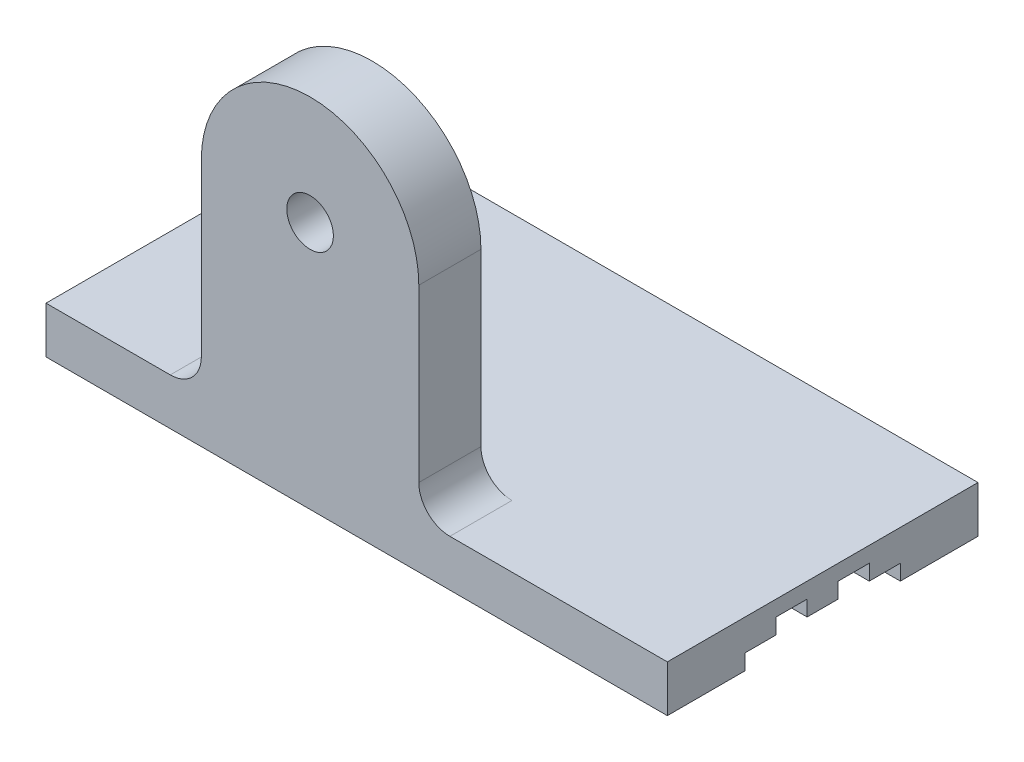
ISO-10303-21;
HEADER;
FILE_DESCRIPTION(('STEP AP214'),'2;1');
FILE_NAME('part.step','',(''),(''),'','','');
FILE_SCHEMA(('AUTOMOTIVE_DESIGN { 1 0 10303 214 1 1 1 1 }'));
ENDSEC;
DATA;
#1=APPLICATION_CONTEXT('core data for automotive mechanical design processes');
#2=APPLICATION_PROTOCOL_DEFINITION('international standard','automotive_design',2000,#1);
#3=PRODUCT_CONTEXT('',#1,'mechanical');
#4=PRODUCT('Part','Part','',(#3));
#5=PRODUCT_RELATED_PRODUCT_CATEGORY('part','',(#4));
#6=PRODUCT_DEFINITION_FORMATION('','',#4);
#7=PRODUCT_DEFINITION_CONTEXT('part definition',#1,'design');
#8=PRODUCT_DEFINITION('design','',#6,#7);
#9=PRODUCT_DEFINITION_SHAPE('','',#8);
#10=(LENGTH_UNIT() NAMED_UNIT(*) SI_UNIT(.MILLI.,.METRE.));
#11=(NAMED_UNIT(*) PLANE_ANGLE_UNIT() SI_UNIT($,.RADIAN.));
#12=(NAMED_UNIT(*) SI_UNIT($,.STERADIAN.) SOLID_ANGLE_UNIT());
#13=UNCERTAINTY_MEASURE_WITH_UNIT(LENGTH_MEASURE(1.E-05),#10,'distance_accuracy_value','');
#14=(GEOMETRIC_REPRESENTATION_CONTEXT(3) GLOBAL_UNCERTAINTY_ASSIGNED_CONTEXT((#13)) GLOBAL_UNIT_ASSIGNED_CONTEXT((#10,
#11,#12)) REPRESENTATION_CONTEXT('',''));
#15=CARTESIAN_POINT('',(0.,0.,0.));
#16=DIRECTION('',(0.,0.,1.));
#17=DIRECTION('',(1.,0.,0.));
#18=AXIS2_PLACEMENT_3D('',#15,#16,#17);
#19=CARTESIAN_POINT('',(0.,15.,0.));
#20=DIRECTION('',(1.,0.,0.));
#21=DIRECTION('',(0.,0.,-1.));
#22=AXIS2_PLACEMENT_3D('',#19,#20,#21);
#23=PLANE('',#22);
#24=DIRECTION('',(0.,-1.,0.));
#25=VECTOR('',#24,1.);
#26=CARTESIAN_POINT('',(0.,5.,-75.));
#27=LINE('',#26,#25);
#28=CARTESIAN_POINT('',(0.,5.,-75.));
#29=VERTEX_POINT('',#28);
#30=CARTESIAN_POINT('',(0.,0.,-75.));
#31=VERTEX_POINT('',#30);
#32=EDGE_CURVE('E185',#29,#31,#27,.T.);
#33=ORIENTED_EDGE('',*,*,#32,.F.);
#34=DIRECTION('',(0.,0.,-1.));
#35=VECTOR('',#34,1.);
#36=CARTESIAN_POINT('',(0.,5.,-65.));
#37=LINE('',#36,#35);
#38=CARTESIAN_POINT('',(0.,5.,-65.));
#39=VERTEX_POINT('',#38);
#40=EDGE_CURVE('E337',#39,#29,#37,.T.);
#41=ORIENTED_EDGE('',*,*,#40,.F.);
#42=DIRECTION('',(0.,-1.,0.));
#43=VECTOR('',#42,1.);
#44=CARTESIAN_POINT('',(0.,10.,-65.));
#45=LINE('',#44,#43);
#46=CARTESIAN_POINT('',(0.,10.,-65.));
#47=VERTEX_POINT('',#46);
#48=EDGE_CURVE('E368',#47,#39,#45,.T.);
#49=ORIENTED_EDGE('',*,*,#48,.F.);
#50=DIRECTION('',(0.,0.,-1.));
#51=VECTOR('',#50,1.);
#52=CARTESIAN_POINT('',(0.,10.,-55.));
#53=LINE('',#52,#51);
#54=CARTESIAN_POINT('',(0.,10.,-55.));
#55=VERTEX_POINT('',#54);
#56=EDGE_CURVE('E370',#55,#47,#53,.T.);
#57=ORIENTED_EDGE('',*,*,#56,.F.);
#58=DIRECTION('',(0.,1.,0.));
#59=VECTOR('',#58,1.);
#60=CARTESIAN_POINT('',(0.,5.,-55.));
#61=LINE('',#60,#59);
#62=CARTESIAN_POINT('',(0.,5.,-55.));
#63=VERTEX_POINT('',#62);
#64=EDGE_CURVE('E372',#63,#55,#61,.T.);
#65=ORIENTED_EDGE('',*,*,#64,.F.);
#66=DIRECTION('',(0.,0.,-1.));
#67=VECTOR('',#66,1.);
#68=CARTESIAN_POINT('',(0.,5.,-45.));
#69=LINE('',#68,#67);
#70=CARTESIAN_POINT('',(0.,5.,-45.));
#71=VERTEX_POINT('',#70);
#72=EDGE_CURVE('E374',#71,#63,#69,.T.);
#73=ORIENTED_EDGE('',*,*,#72,.F.);
#74=DIRECTION('',(0.,-1.,0.));
#75=VECTOR('',#74,1.);
#76=CARTESIAN_POINT('',(0.,10.,-45.));
#77=LINE('',#76,#75);
#78=CARTESIAN_POINT('',(0.,10.,-45.));
#79=VERTEX_POINT('',#78);
#80=EDGE_CURVE('E376',#79,#71,#77,.T.);
#81=ORIENTED_EDGE('',*,*,#80,.F.);
#82=DIRECTION('',(0.,0.,-1.));
#83=VECTOR('',#82,1.);
#84=CARTESIAN_POINT('',(0.,10.,-35.));
#85=LINE('',#84,#83);
#86=CARTESIAN_POINT('',(0.,10.,-35.));
#87=VERTEX_POINT('',#86);
#88=EDGE_CURVE('E378',#87,#79,#85,.T.);
#89=ORIENTED_EDGE('',*,*,#88,.F.);
#90=DIRECTION('',(0.,1.,0.));
#91=VECTOR('',#90,1.);
#92=CARTESIAN_POINT('',(0.,5.,-35.));
#93=LINE('',#92,#91);
#94=CARTESIAN_POINT('',(0.,5.,-35.));
#95=VERTEX_POINT('',#94);
#96=EDGE_CURVE('E380',#95,#87,#93,.T.);
#97=ORIENTED_EDGE('',*,*,#96,.F.);
#98=DIRECTION('',(0.,0.,-1.));
#99=VECTOR('',#98,1.);
#100=CARTESIAN_POINT('',(0.,5.,-25.));
#101=LINE('',#100,#99);
#102=CARTESIAN_POINT('',(0.,5.,-25.));
#103=VERTEX_POINT('',#102);
#104=EDGE_CURVE('E382',#103,#95,#101,.T.);
#105=ORIENTED_EDGE('',*,*,#104,.F.);
#106=DIRECTION('',(0.,1.,0.));
#107=VECTOR('',#106,1.);
#108=CARTESIAN_POINT('',(0.,0.,-25.));
#109=LINE('',#108,#107);
#110=CARTESIAN_POINT('',(0.,0.,-25.));
#111=VERTEX_POINT('',#110);
#112=EDGE_CURVE('E195',#111,#103,#109,.T.);
#113=ORIENTED_EDGE('',*,*,#112,.F.);
#114=DIRECTION('',(0.,0.,1.));
#115=VECTOR('',#114,1.);
#116=CARTESIAN_POINT('',(0.,0.,0.));
#117=LINE('',#116,#115);
#118=CARTESIAN_POINT('',(0.,0.,0.));
#119=VERTEX_POINT('',#118);
#120=EDGE_CURVE('E213',#111,#119,#117,.T.);
#121=ORIENTED_EDGE('',*,*,#120,.T.);
#122=DIRECTION('',(0.,-1.,0.));
#123=VECTOR('',#122,1.);
#124=CARTESIAN_POINT('',(0.,15.,0.));
#125=LINE('',#124,#123);
#126=CARTESIAN_POINT('',(0.,15.,0.));
#127=VERTEX_POINT('',#126);
#128=EDGE_CURVE('E234',#127,#119,#125,.T.);
#129=ORIENTED_EDGE('',*,*,#128,.F.);
#130=DIRECTION('',(0.,0.,1.));
#131=VECTOR('',#130,1.);
#132=CARTESIAN_POINT('',(0.,15.,0.));
#133=LINE('',#132,#131);
#134=CARTESIAN_POINT('',(0.,15.,-100.));
#135=VERTEX_POINT('',#134);
#136=EDGE_CURVE('E226',#135,#127,#133,.T.);
#137=ORIENTED_EDGE('',*,*,#136,.F.);
#138=DIRECTION('',(0.,-1.,0.));
#139=VECTOR('',#138,1.);
#140=CARTESIAN_POINT('',(0.,15.,-100.));
#141=LINE('',#140,#139);
#142=CARTESIAN_POINT('',(0.,0.,-100.));
#143=VERTEX_POINT('',#142);
#144=EDGE_CURVE('E211',#135,#143,#141,.T.);
#145=ORIENTED_EDGE('',*,*,#144,.T.);
#146=EDGE_CURVE('E203',#143,#31,#117,.T.);
#147=ORIENTED_EDGE('',*,*,#146,.T.);
#148=EDGE_LOOP('',(#33,#41,#49,#57,#65,#73,#81,#89,#97,#105,#113,#121,#129,#137,#145,#147));
#149=FACE_BOUND('',#148,.T.);
#150=ADVANCED_FACE('F37',(#149),#23,.F.);
#151=CARTESIAN_POINT('',(200.,15.,0.));
#152=DIRECTION('',(-1.,0.,0.));
#153=DIRECTION('',(0.,0.,1.));
#154=AXIS2_PLACEMENT_3D('',#151,#152,#153);
#155=PLANE('',#154);
#156=DIRECTION('',(0.,-1.,0.));
#157=VECTOR('',#156,1.);
#158=CARTESIAN_POINT('',(200.,5.,-75.));
#159=LINE('',#158,#157);
#160=CARTESIAN_POINT('',(200.,5.,-75.));
#161=VERTEX_POINT('',#160);
#162=CARTESIAN_POINT('',(200.,0.,-75.));
#163=VERTEX_POINT('',#162);
#164=EDGE_CURVE('E241',#161,#163,#159,.T.);
#165=ORIENTED_EDGE('',*,*,#164,.T.);
#166=DIRECTION('',(0.,0.,-1.));
#167=VECTOR('',#166,1.);
#168=CARTESIAN_POINT('',(200.,0.,0.));
#169=LINE('',#168,#167);
#170=CARTESIAN_POINT('',(200.,0.,-100.));
#171=VERTEX_POINT('',#170);
#172=EDGE_CURVE('E204',#163,#171,#169,.T.);
#173=ORIENTED_EDGE('',*,*,#172,.T.);
#174=DIRECTION('',(0.,-1.,0.));
#175=VECTOR('',#174,1.);
#176=CARTESIAN_POINT('',(200.,15.,-100.));
#177=LINE('',#176,#175);
#178=CARTESIAN_POINT('',(200.,15.,-100.));
#179=VERTEX_POINT('',#178);
#180=EDGE_CURVE('E228',#179,#171,#177,.T.);
#181=ORIENTED_EDGE('',*,*,#180,.F.);
#182=DIRECTION('',(0.,0.,-1.));
#183=VECTOR('',#182,1.);
#184=CARTESIAN_POINT('',(200.,15.,0.));
#185=LINE('',#184,#183);
#186=CARTESIAN_POINT('',(200.,15.,0.));
#187=VERTEX_POINT('',#186);
#188=EDGE_CURVE('E268',#187,#179,#185,.T.);
#189=ORIENTED_EDGE('',*,*,#188,.F.);
#190=DIRECTION('',(0.,-1.,0.));
#191=VECTOR('',#190,1.);
#192=CARTESIAN_POINT('',(200.,15.,0.));
#193=LINE('',#192,#191);
#194=CARTESIAN_POINT('',(200.,0.,0.));
#195=VERTEX_POINT('',#194);
#196=EDGE_CURVE('E231',#187,#195,#193,.T.);
#197=ORIENTED_EDGE('',*,*,#196,.T.);
#198=CARTESIAN_POINT('',(200.,0.,-25.));
#199=VERTEX_POINT('',#198);
#200=EDGE_CURVE('E221',#195,#199,#169,.T.);
#201=ORIENTED_EDGE('',*,*,#200,.T.);
#202=DIRECTION('',(0.,1.,0.));
#203=VECTOR('',#202,1.);
#204=CARTESIAN_POINT('',(200.,0.,-25.));
#205=LINE('',#204,#203);
#206=CARTESIAN_POINT('',(200.,5.,-25.));
#207=VERTEX_POINT('',#206);
#208=EDGE_CURVE('E364',#199,#207,#205,.T.);
#209=ORIENTED_EDGE('',*,*,#208,.T.);
#210=DIRECTION('',(0.,0.,-1.));
#211=VECTOR('',#210,1.);
#212=CARTESIAN_POINT('',(200.,5.,-25.));
#213=LINE('',#212,#211);
#214=CARTESIAN_POINT('',(200.,5.,-35.));
#215=VERTEX_POINT('',#214);
#216=EDGE_CURVE('E361',#207,#215,#213,.T.);
#217=ORIENTED_EDGE('',*,*,#216,.T.);
#218=DIRECTION('',(0.,1.,0.));
#219=VECTOR('',#218,1.);
#220=CARTESIAN_POINT('',(200.,5.,-35.));
#221=LINE('',#220,#219);
#222=CARTESIAN_POINT('',(200.,10.,-35.));
#223=VERTEX_POINT('',#222);
#224=EDGE_CURVE('E358',#215,#223,#221,.T.);
#225=ORIENTED_EDGE('',*,*,#224,.T.);
#226=DIRECTION('',(0.,0.,-1.));
#227=VECTOR('',#226,1.);
#228=CARTESIAN_POINT('',(200.,10.,-35.));
#229=LINE('',#228,#227);
#230=CARTESIAN_POINT('',(200.,10.,-45.));
#231=VERTEX_POINT('',#230);
#232=EDGE_CURVE('E355',#223,#231,#229,.T.);
#233=ORIENTED_EDGE('',*,*,#232,.T.);
#234=DIRECTION('',(0.,-1.,0.));
#235=VECTOR('',#234,1.);
#236=CARTESIAN_POINT('',(200.,10.,-45.));
#237=LINE('',#236,#235);
#238=CARTESIAN_POINT('',(200.,5.,-45.));
#239=VERTEX_POINT('',#238);
#240=EDGE_CURVE('E352',#231,#239,#237,.T.);
#241=ORIENTED_EDGE('',*,*,#240,.T.);
#242=DIRECTION('',(0.,0.,-1.));
#243=VECTOR('',#242,1.);
#244=CARTESIAN_POINT('',(200.,5.,-45.));
#245=LINE('',#244,#243);
#246=CARTESIAN_POINT('',(200.,5.,-55.));
#247=VERTEX_POINT('',#246);
#248=EDGE_CURVE('E349',#239,#247,#245,.T.);
#249=ORIENTED_EDGE('',*,*,#248,.T.);
#250=DIRECTION('',(0.,1.,0.));
#251=VECTOR('',#250,1.);
#252=CARTESIAN_POINT('',(200.,5.,-55.));
#253=LINE('',#252,#251);
#254=CARTESIAN_POINT('',(200.,10.,-55.));
#255=VERTEX_POINT('',#254);
#256=EDGE_CURVE('E346',#247,#255,#253,.T.);
#257=ORIENTED_EDGE('',*,*,#256,.T.);
#258=DIRECTION('',(0.,0.,-1.));
#259=VECTOR('',#258,1.);
#260=CARTESIAN_POINT('',(200.,10.,-55.));
#261=LINE('',#260,#259);
#262=CARTESIAN_POINT('',(200.,10.,-65.));
#263=VERTEX_POINT('',#262);
#264=EDGE_CURVE('E343',#255,#263,#261,.T.);
#265=ORIENTED_EDGE('',*,*,#264,.T.);
#266=DIRECTION('',(0.,-1.,0.));
#267=VECTOR('',#266,1.);
#268=CARTESIAN_POINT('',(200.,10.,-65.));
#269=LINE('',#268,#267);
#270=CARTESIAN_POINT('',(200.,5.,-65.));
#271=VERTEX_POINT('',#270);
#272=EDGE_CURVE('E340',#263,#271,#269,.T.);
#273=ORIENTED_EDGE('',*,*,#272,.T.);
#274=DIRECTION('',(0.,0.,-1.));
#275=VECTOR('',#274,1.);
#276=CARTESIAN_POINT('',(200.,5.,-65.));
#277=LINE('',#276,#275);
#278=EDGE_CURVE('E196',#271,#161,#277,.T.);
#279=ORIENTED_EDGE('',*,*,#278,.T.);
#280=EDGE_LOOP('',(#165,#173,#181,#189,#197,#201,#209,#217,#225,#233,#241,#249,#257,#265,#273,#279));
#281=FACE_BOUND('',#280,.T.);
#282=ADVANCED_FACE('F312',(#281),#155,.F.);
#283=CARTESIAN_POINT('',(0.,0.,0.));
#284=DIRECTION('',(0.,-1.,0.));
#285=DIRECTION('',(0.,0.,-1.));
#286=AXIS2_PLACEMENT_3D('',#283,#284,#285);
#287=PLANE('',#286);
#288=ORIENTED_EDGE('',*,*,#172,.F.);
#289=DIRECTION('',(1.,0.,0.));
#290=VECTOR('',#289,1.);
#291=CARTESIAN_POINT('',(0.,0.,-75.));
#292=LINE('',#291,#290);
#293=EDGE_CURVE('E189',#31,#163,#292,.T.);
#294=ORIENTED_EDGE('',*,*,#293,.F.);
#295=ORIENTED_EDGE('',*,*,#146,.F.);
#296=DIRECTION('',(-1.,0.,0.));
#297=VECTOR('',#296,1.);
#298=CARTESIAN_POINT('',(0.,0.,-100.));
#299=LINE('',#298,#297);
#300=EDGE_CURVE('E224',#171,#143,#299,.T.);
#301=ORIENTED_EDGE('',*,*,#300,.F.);
#302=EDGE_LOOP('',(#288,#294,#295,#301));
#303=FACE_BOUND('',#302,.T.);
#304=ADVANCED_FACE('F201',(#303),#287,.T.);
#305=ORIENTED_EDGE('',*,*,#120,.F.);
#306=DIRECTION('',(1.,0.,0.));
#307=VECTOR('',#306,1.);
#308=CARTESIAN_POINT('',(0.,0.,-25.));
#309=LINE('',#308,#307);
#310=EDGE_CURVE('E206',#111,#199,#309,.T.);
#311=ORIENTED_EDGE('',*,*,#310,.T.);
#312=ORIENTED_EDGE('',*,*,#200,.F.);
#313=DIRECTION('',(1.,0.,0.));
#314=VECTOR('',#313,1.);
#315=CARTESIAN_POINT('',(0.,0.,0.));
#316=LINE('',#315,#314);
#317=EDGE_CURVE('E212',#119,#195,#316,.T.);
#318=ORIENTED_EDGE('',*,*,#317,.F.);
#319=EDGE_LOOP('',(#305,#311,#312,#318));
#320=FACE_BOUND('',#319,.T.);
#321=ADVANCED_FACE('F315',(#320),#287,.T.);
#322=CARTESIAN_POINT('',(0.,15.,0.));
#323=DIRECTION('',(0.,0.,-1.));
#324=DIRECTION('',(-1.,0.,0.));
#325=AXIS2_PLACEMENT_3D('',#322,#323,#324);
#326=PLANE('',#325);
#327=CARTESIAN_POINT('',(85.,80.,0.));
#328=DIRECTION('',(0.,0.,1.));
#329=DIRECTION('',(1.,0.,0.));
#330=AXIS2_PLACEMENT_3D('',#327,#328,#329);
#331=CIRCLE('',#330,7.5);
#332=CARTESIAN_POINT('',(92.5,80.,0.));
#333=VERTEX_POINT('',#332);
#334=EDGE_CURVE('E242',#333,#333,#331,.T.);
#335=ORIENTED_EDGE('',*,*,#334,.F.);
#336=EDGE_LOOP('',(#335));
#337=FACE_BOUND('',#336,.T.);
#338=DIRECTION('',(1.,0.,0.));
#339=VECTOR('',#338,1.);
#340=CARTESIAN_POINT('',(0.,15.,0.));
#341=LINE('',#340,#339);
#342=CARTESIAN_POINT('',(130.,15.,0.));
#343=VERTEX_POINT('',#342);
#344=EDGE_CURVE('E269',#343,#187,#341,.T.);
#345=ORIENTED_EDGE('',*,*,#344,.F.);
#346=CARTESIAN_POINT('',(130.,25.,0.));
#347=DIRECTION('',(0.,0.,-1.));
#348=DIRECTION('',(-1.,0.,0.));
#349=AXIS2_PLACEMENT_3D('',#346,#347,#348);
#350=CIRCLE('',#349,10.);
#351=CARTESIAN_POINT('',(120.,25.,0.));
#352=VERTEX_POINT('',#351);
#353=EDGE_CURVE('E45',#343,#352,#350,.T.);
#354=ORIENTED_EDGE('',*,*,#353,.T.);
#355=DIRECTION('',(0.,1.,0.));
#356=VECTOR('',#355,1.);
#357=CARTESIAN_POINT('',(120.,0.,0.));
#358=LINE('',#357,#356);
#359=CARTESIAN_POINT('',(120.,80.,0.));
#360=VERTEX_POINT('',#359);
#361=EDGE_CURVE('E288',#352,#360,#358,.T.);
#362=ORIENTED_EDGE('',*,*,#361,.T.);
#363=CARTESIAN_POINT('',(85.,80.,0.));
#364=DIRECTION('',(0.,0.,1.));
#365=DIRECTION('',(1.,0.,0.));
#366=AXIS2_PLACEMENT_3D('',#363,#364,#365);
#367=CIRCLE('',#366,35.);
#368=CARTESIAN_POINT('',(50.,80.,0.));
#369=VERTEX_POINT('',#368);
#370=EDGE_CURVE('E284',#360,#369,#367,.T.);
#371=ORIENTED_EDGE('',*,*,#370,.T.);
#372=DIRECTION('',(0.,-1.,0.));
#373=VECTOR('',#372,1.);
#374=CARTESIAN_POINT('',(50.,0.,0.));
#375=LINE('',#374,#373);
#376=CARTESIAN_POINT('',(50.,25.,0.));
#377=VERTEX_POINT('',#376);
#378=EDGE_CURVE('E205',#369,#377,#375,.T.);
#379=ORIENTED_EDGE('',*,*,#378,.T.);
#380=CARTESIAN_POINT('',(40.,25.,0.));
#381=DIRECTION('',(0.,0.,-1.));
#382=DIRECTION('',(-1.,0.,0.));
#383=AXIS2_PLACEMENT_3D('',#380,#381,#382);
#384=CIRCLE('',#383,10.);
#385=CARTESIAN_POINT('',(40.,15.,0.));
#386=VERTEX_POINT('',#385);
#387=EDGE_CURVE('E253',#377,#386,#384,.T.);
#388=ORIENTED_EDGE('',*,*,#387,.T.);
#389=EDGE_CURVE('E258',#127,#386,#341,.T.);
#390=ORIENTED_EDGE('',*,*,#389,.F.);
#391=ORIENTED_EDGE('',*,*,#128,.T.);
#392=ORIENTED_EDGE('',*,*,#317,.T.);
#393=ORIENTED_EDGE('',*,*,#196,.F.);
#394=EDGE_LOOP('',(#345,#354,#362,#371,#379,#388,#390,#391,#392,#393));
#395=FACE_BOUND('',#394,.T.);
#396=ADVANCED_FACE('F257',(#337,#395),#326,.F.);
#397=CARTESIAN_POINT('',(0.,15.,-100.));
#398=DIRECTION('',(0.,0.,1.));
#399=DIRECTION('',(1.,0.,0.));
#400=AXIS2_PLACEMENT_3D('',#397,#398,#399);
#401=PLANE('',#400);
#402=ORIENTED_EDGE('',*,*,#300,.T.);
#403=ORIENTED_EDGE('',*,*,#144,.F.);
#404=DIRECTION('',(-1.,0.,0.));
#405=VECTOR('',#404,1.);
#406=CARTESIAN_POINT('',(0.,15.,-100.));
#407=LINE('',#406,#405);
#408=EDGE_CURVE('E218',#179,#135,#407,.T.);
#409=ORIENTED_EDGE('',*,*,#408,.F.);
#410=ORIENTED_EDGE('',*,*,#180,.T.);
#411=EDGE_LOOP('',(#402,#403,#409,#410));
#412=FACE_BOUND('',#411,.T.);
#413=ADVANCED_FACE('F304',(#412),#401,.F.);
#414=CARTESIAN_POINT('',(0.,15.,0.));
#415=DIRECTION('',(0.,-1.,0.));
#416=DIRECTION('',(0.,0.,-1.));
#417=AXIS2_PLACEMENT_3D('',#414,#415,#416);
#418=PLANE('',#417);
#419=ORIENTED_EDGE('',*,*,#389,.T.);
#420=DIRECTION('',(0.,0.,-1.));
#421=VECTOR('',#420,1.);
#422=CARTESIAN_POINT('',(40.,15.,0.));
#423=LINE('',#422,#421);
#424=CARTESIAN_POINT('',(40.,15.,-20.));
#425=VERTEX_POINT('',#424);
#426=EDGE_CURVE('E245',#386,#425,#423,.T.);
#427=ORIENTED_EDGE('',*,*,#426,.T.);
#428=DIRECTION('',(-1.,0.,0.));
#429=VECTOR('',#428,1.);
#430=CARTESIAN_POINT('',(0.,15.,-20.));
#431=LINE('',#430,#429);
#432=CARTESIAN_POINT('',(130.,15.,-20.));
#433=VERTEX_POINT('',#432);
#434=EDGE_CURVE('E216',#433,#425,#431,.T.);
#435=ORIENTED_EDGE('',*,*,#434,.F.);
#436=DIRECTION('',(0.,0.,1.));
#437=VECTOR('',#436,1.);
#438=CARTESIAN_POINT('',(130.,15.,0.));
#439=LINE('',#438,#437);
#440=EDGE_CURVE('E237',#433,#343,#439,.T.);
#441=ORIENTED_EDGE('',*,*,#440,.T.);
#442=ORIENTED_EDGE('',*,*,#344,.T.);
#443=ORIENTED_EDGE('',*,*,#188,.T.);
#444=ORIENTED_EDGE('',*,*,#408,.T.);
#445=ORIENTED_EDGE('',*,*,#136,.T.);
#446=EDGE_LOOP('',(#419,#427,#435,#441,#442,#443,#444,#445));
#447=FACE_BOUND('',#446,.T.);
#448=ADVANCED_FACE('F266',(#447),#418,.F.);
#449=CARTESIAN_POINT('',(50.,0.,-20.));
#450=DIRECTION('',(-1.,0.,0.));
#451=DIRECTION('',(0.,0.,1.));
#452=AXIS2_PLACEMENT_3D('',#449,#450,#451);
#453=PLANE('',#452);
#454=DIRECTION('',(0.,-1.,0.));
#455=VECTOR('',#454,1.);
#456=CARTESIAN_POINT('',(50.,0.,-20.));
#457=LINE('',#456,#455);
#458=CARTESIAN_POINT('',(50.,80.,-20.));
#459=VERTEX_POINT('',#458);
#460=CARTESIAN_POINT('',(50.,25.,-20.));
#461=VERTEX_POINT('',#460);
#462=EDGE_CURVE('E278',#459,#461,#457,.T.);
#463=ORIENTED_EDGE('',*,*,#462,.T.);
#464=DIRECTION('',(0.,0.,-1.));
#465=VECTOR('',#464,1.);
#466=CARTESIAN_POINT('',(50.,25.,-20.));
#467=LINE('',#466,#465);
#468=EDGE_CURVE('E248',#461,#377,#467,.F.);
#469=ORIENTED_EDGE('',*,*,#468,.T.);
#470=ORIENTED_EDGE('',*,*,#378,.F.);
#471=DIRECTION('',(0.,0.,1.));
#472=VECTOR('',#471,1.);
#473=CARTESIAN_POINT('',(50.,80.,-20.));
#474=LINE('',#473,#472);
#475=EDGE_CURVE('E282',#459,#369,#474,.T.);
#476=ORIENTED_EDGE('',*,*,#475,.F.);
#477=EDGE_LOOP('',(#463,#469,#470,#476));
#478=FACE_BOUND('',#477,.T.);
#479=ADVANCED_FACE('F281',(#478),#453,.T.);
#480=CARTESIAN_POINT('',(120.,0.,-20.));
#481=DIRECTION('',(1.,0.,0.));
#482=DIRECTION('',(0.,0.,-1.));
#483=AXIS2_PLACEMENT_3D('',#480,#481,#482);
#484=PLANE('',#483);
#485=ORIENTED_EDGE('',*,*,#361,.F.);
#486=DIRECTION('',(0.,0.,1.));
#487=VECTOR('',#486,1.);
#488=CARTESIAN_POINT('',(120.,25.,-20.));
#489=LINE('',#488,#487);
#490=CARTESIAN_POINT('',(120.,25.,-20.));
#491=VERTEX_POINT('',#490);
#492=EDGE_CURVE('E58',#352,#491,#489,.F.);
#493=ORIENTED_EDGE('',*,*,#492,.T.);
#494=DIRECTION('',(0.,1.,0.));
#495=VECTOR('',#494,1.);
#496=CARTESIAN_POINT('',(120.,0.,-20.));
#497=LINE('',#496,#495);
#498=CARTESIAN_POINT('',(120.,80.,-20.));
#499=VERTEX_POINT('',#498);
#500=EDGE_CURVE('E283',#491,#499,#497,.T.);
#501=ORIENTED_EDGE('',*,*,#500,.T.);
#502=DIRECTION('',(0.,0.,1.));
#503=VECTOR('',#502,1.);
#504=CARTESIAN_POINT('',(120.,80.,-20.));
#505=LINE('',#504,#503);
#506=EDGE_CURVE('E293',#499,#360,#505,.T.);
#507=ORIENTED_EDGE('',*,*,#506,.T.);
#508=EDGE_LOOP('',(#485,#493,#501,#507));
#509=FACE_BOUND('',#508,.T.);
#510=ADVANCED_FACE('F460',(#509),#484,.T.);
#511=CARTESIAN_POINT('',(85.,80.,-20.));
#512=DIRECTION('',(0.,0.,1.));
#513=DIRECTION('',(1.,0.,0.));
#514=AXIS2_PLACEMENT_3D('',#511,#512,#513);
#515=PLANE('',#514);
#516=CARTESIAN_POINT('',(85.,80.,-20.));
#517=DIRECTION('',(0.,0.,1.));
#518=DIRECTION('',(1.,0.,0.));
#519=AXIS2_PLACEMENT_3D('',#516,#517,#518);
#520=CIRCLE('',#519,7.5);
#521=CARTESIAN_POINT('',(92.5,80.,-20.));
#522=VERTEX_POINT('',#521);
#523=EDGE_CURVE('E238',#522,#522,#520,.T.);
#524=ORIENTED_EDGE('',*,*,#523,.T.);
#525=EDGE_LOOP('',(#524));
#526=FACE_BOUND('',#525,.T.);
#527=ORIENTED_EDGE('',*,*,#500,.F.);
#528=CARTESIAN_POINT('',(130.,25.,-20.));
#529=DIRECTION('',(0.,0.,1.));
#530=DIRECTION('',(1.,0.,0.));
#531=AXIS2_PLACEMENT_3D('',#528,#529,#530);
#532=CIRCLE('',#531,10.);
#533=EDGE_CURVE('E11',#491,#433,#532,.T.);
#534=ORIENTED_EDGE('',*,*,#533,.T.);
#535=ORIENTED_EDGE('',*,*,#434,.T.);
#536=CARTESIAN_POINT('',(40.,25.,-20.));
#537=DIRECTION('',(0.,0.,1.));
#538=DIRECTION('',(1.,0.,0.));
#539=AXIS2_PLACEMENT_3D('',#536,#537,#538);
#540=CIRCLE('',#539,10.);
#541=EDGE_CURVE('E251',#425,#461,#540,.T.);
#542=ORIENTED_EDGE('',*,*,#541,.T.);
#543=ORIENTED_EDGE('',*,*,#462,.F.);
#544=CARTESIAN_POINT('',(85.,80.,-20.));
#545=DIRECTION('',(0.,0.,1.));
#546=DIRECTION('',(1.,0.,0.));
#547=AXIS2_PLACEMENT_3D('',#544,#545,#546);
#548=CIRCLE('',#547,35.);
#549=EDGE_CURVE('E286',#499,#459,#548,.T.);
#550=ORIENTED_EDGE('',*,*,#549,.F.);
#551=EDGE_LOOP('',(#527,#534,#535,#542,#543,#550));
#552=FACE_BOUND('',#551,.T.);
#553=ADVANCED_FACE('F276',(#526,#552),#515,.F.);
#554=CARTESIAN_POINT('',(85.,80.,-20.));
#555=DIRECTION('',(0.,0.,1.));
#556=DIRECTION('',(1.,0.,0.));
#557=AXIS2_PLACEMENT_3D('',#554,#555,#556);
#558=CYLINDRICAL_SURFACE('',#557,35.);
#559=ORIENTED_EDGE('',*,*,#370,.F.);
#560=ORIENTED_EDGE('',*,*,#506,.F.);
#561=ORIENTED_EDGE('',*,*,#549,.T.);
#562=ORIENTED_EDGE('',*,*,#475,.T.);
#563=EDGE_LOOP('',(#559,#560,#561,#562));
#564=FACE_BOUND('',#563,.T.);
#565=ADVANCED_FACE('F457',(#564),#558,.T.);
#566=CARTESIAN_POINT('',(0.,5.,-75.));
#567=DIRECTION('',(0.,0.,1.));
#568=DIRECTION('',(1.,0.,0.));
#569=AXIS2_PLACEMENT_3D('',#566,#567,#568);
#570=PLANE('',#569);
#571=ORIENTED_EDGE('',*,*,#164,.F.);
#572=DIRECTION('',(1.,0.,0.));
#573=VECTOR('',#572,1.);
#574=CARTESIAN_POINT('',(0.,5.,-75.));
#575=LINE('',#574,#573);
#576=EDGE_CURVE('E191',#29,#161,#575,.T.);
#577=ORIENTED_EDGE('',*,*,#576,.F.);
#578=ORIENTED_EDGE('',*,*,#32,.T.);
#579=ORIENTED_EDGE('',*,*,#293,.T.);
#580=EDGE_LOOP('',(#571,#577,#578,#579));
#581=FACE_BOUND('',#580,.T.);
#582=ADVANCED_FACE('F188',(#581),#570,.T.);
#583=CARTESIAN_POINT('',(0.,0.,-25.));
#584=DIRECTION('',(0.,0.,-1.));
#585=DIRECTION('',(-1.,0.,0.));
#586=AXIS2_PLACEMENT_3D('',#583,#584,#585);
#587=PLANE('',#586);
#588=ORIENTED_EDGE('',*,*,#208,.F.);
#589=ORIENTED_EDGE('',*,*,#310,.F.);
#590=ORIENTED_EDGE('',*,*,#112,.T.);
#591=DIRECTION('',(1.,0.,0.));
#592=VECTOR('',#591,1.);
#593=CARTESIAN_POINT('',(0.,5.,-25.));
#594=LINE('',#593,#592);
#595=EDGE_CURVE('E317',#103,#207,#594,.T.);
#596=ORIENTED_EDGE('',*,*,#595,.T.);
#597=EDGE_LOOP('',(#588,#589,#590,#596));
#598=FACE_BOUND('',#597,.T.);
#599=ADVANCED_FACE('F451',(#598),#587,.T.);
#600=CARTESIAN_POINT('',(0.,5.,-25.));
#601=DIRECTION('',(0.,-1.,0.));
#602=DIRECTION('',(0.,0.,-1.));
#603=AXIS2_PLACEMENT_3D('',#600,#601,#602);
#604=PLANE('',#603);
#605=ORIENTED_EDGE('',*,*,#216,.F.);
#606=ORIENTED_EDGE('',*,*,#595,.F.);
#607=ORIENTED_EDGE('',*,*,#104,.T.);
#608=DIRECTION('',(1.,0.,0.));
#609=VECTOR('',#608,1.);
#610=CARTESIAN_POINT('',(0.,5.,-35.));
#611=LINE('',#610,#609);
#612=EDGE_CURVE('E318',#95,#215,#611,.T.);
#613=ORIENTED_EDGE('',*,*,#612,.T.);
#614=EDGE_LOOP('',(#605,#606,#607,#613));
#615=FACE_BOUND('',#614,.T.);
#616=ADVANCED_FACE('F447',(#615),#604,.T.);
#617=CARTESIAN_POINT('',(0.,5.,-35.));
#618=DIRECTION('',(0.,0.,-1.));
#619=DIRECTION('',(-1.,0.,0.));
#620=AXIS2_PLACEMENT_3D('',#617,#618,#619);
#621=PLANE('',#620);
#622=ORIENTED_EDGE('',*,*,#224,.F.);
#623=ORIENTED_EDGE('',*,*,#612,.F.);
#624=ORIENTED_EDGE('',*,*,#96,.T.);
#625=DIRECTION('',(1.,0.,0.));
#626=VECTOR('',#625,1.);
#627=CARTESIAN_POINT('',(0.,10.,-35.));
#628=LINE('',#627,#626);
#629=EDGE_CURVE('E322',#87,#223,#628,.T.);
#630=ORIENTED_EDGE('',*,*,#629,.T.);
#631=EDGE_LOOP('',(#622,#623,#624,#630));
#632=FACE_BOUND('',#631,.T.);
#633=ADVANCED_FACE('F443',(#632),#621,.T.);
#634=CARTESIAN_POINT('',(0.,10.,-35.));
#635=DIRECTION('',(0.,-1.,0.));
#636=DIRECTION('',(0.,0.,-1.));
#637=AXIS2_PLACEMENT_3D('',#634,#635,#636);
#638=PLANE('',#637);
#639=ORIENTED_EDGE('',*,*,#232,.F.);
#640=ORIENTED_EDGE('',*,*,#629,.F.);
#641=ORIENTED_EDGE('',*,*,#88,.T.);
#642=DIRECTION('',(1.,0.,0.));
#643=VECTOR('',#642,1.);
#644=CARTESIAN_POINT('',(0.,10.,-45.));
#645=LINE('',#644,#643);
#646=EDGE_CURVE('E324',#79,#231,#645,.T.);
#647=ORIENTED_EDGE('',*,*,#646,.T.);
#648=EDGE_LOOP('',(#639,#640,#641,#647));
#649=FACE_BOUND('',#648,.T.);
#650=ADVANCED_FACE('F439',(#649),#638,.T.);
#651=CARTESIAN_POINT('',(0.,10.,-45.));
#652=DIRECTION('',(0.,0.,1.));
#653=DIRECTION('',(1.,0.,0.));
#654=AXIS2_PLACEMENT_3D('',#651,#652,#653);
#655=PLANE('',#654);
#656=ORIENTED_EDGE('',*,*,#240,.F.);
#657=ORIENTED_EDGE('',*,*,#646,.F.);
#658=ORIENTED_EDGE('',*,*,#80,.T.);
#659=DIRECTION('',(1.,0.,0.));
#660=VECTOR('',#659,1.);
#661=CARTESIAN_POINT('',(0.,5.,-45.));
#662=LINE('',#661,#660);
#663=EDGE_CURVE('E326',#71,#239,#662,.T.);
#664=ORIENTED_EDGE('',*,*,#663,.T.);
#665=EDGE_LOOP('',(#656,#657,#658,#664));
#666=FACE_BOUND('',#665,.T.);
#667=ADVANCED_FACE('F435',(#666),#655,.T.);
#668=CARTESIAN_POINT('',(0.,5.,-45.));
#669=DIRECTION('',(0.,-1.,0.));
#670=DIRECTION('',(0.,0.,-1.));
#671=AXIS2_PLACEMENT_3D('',#668,#669,#670);
#672=PLANE('',#671);
#673=ORIENTED_EDGE('',*,*,#248,.F.);
#674=ORIENTED_EDGE('',*,*,#663,.F.);
#675=ORIENTED_EDGE('',*,*,#72,.T.);
#676=DIRECTION('',(1.,0.,0.));
#677=VECTOR('',#676,1.);
#678=CARTESIAN_POINT('',(0.,5.,-55.));
#679=LINE('',#678,#677);
#680=EDGE_CURVE('E328',#63,#247,#679,.T.);
#681=ORIENTED_EDGE('',*,*,#680,.T.);
#682=EDGE_LOOP('',(#673,#674,#675,#681));
#683=FACE_BOUND('',#682,.T.);
#684=ADVANCED_FACE('F431',(#683),#672,.T.);
#685=CARTESIAN_POINT('',(0.,5.,-55.));
#686=DIRECTION('',(0.,0.,-1.));
#687=DIRECTION('',(-1.,0.,0.));
#688=AXIS2_PLACEMENT_3D('',#685,#686,#687);
#689=PLANE('',#688);
#690=ORIENTED_EDGE('',*,*,#256,.F.);
#691=ORIENTED_EDGE('',*,*,#680,.F.);
#692=ORIENTED_EDGE('',*,*,#64,.T.);
#693=DIRECTION('',(1.,0.,0.));
#694=VECTOR('',#693,1.);
#695=CARTESIAN_POINT('',(0.,10.,-55.));
#696=LINE('',#695,#694);
#697=EDGE_CURVE('E330',#55,#255,#696,.T.);
#698=ORIENTED_EDGE('',*,*,#697,.T.);
#699=EDGE_LOOP('',(#690,#691,#692,#698));
#700=FACE_BOUND('',#699,.T.);
#701=ADVANCED_FACE('F427',(#700),#689,.T.);
#702=CARTESIAN_POINT('',(0.,10.,-55.));
#703=DIRECTION('',(0.,-1.,0.));
#704=DIRECTION('',(0.,0.,-1.));
#705=AXIS2_PLACEMENT_3D('',#702,#703,#704);
#706=PLANE('',#705);
#707=ORIENTED_EDGE('',*,*,#264,.F.);
#708=ORIENTED_EDGE('',*,*,#697,.F.);
#709=ORIENTED_EDGE('',*,*,#56,.T.);
#710=DIRECTION('',(1.,0.,0.));
#711=VECTOR('',#710,1.);
#712=CARTESIAN_POINT('',(0.,10.,-65.));
#713=LINE('',#712,#711);
#714=EDGE_CURVE('E332',#47,#263,#713,.T.);
#715=ORIENTED_EDGE('',*,*,#714,.T.);
#716=EDGE_LOOP('',(#707,#708,#709,#715));
#717=FACE_BOUND('',#716,.T.);
#718=ADVANCED_FACE('F423',(#717),#706,.T.);
#719=CARTESIAN_POINT('',(0.,10.,-65.));
#720=DIRECTION('',(0.,0.,1.));
#721=DIRECTION('',(1.,0.,0.));
#722=AXIS2_PLACEMENT_3D('',#719,#720,#721);
#723=PLANE('',#722);
#724=ORIENTED_EDGE('',*,*,#272,.F.);
#725=ORIENTED_EDGE('',*,*,#714,.F.);
#726=ORIENTED_EDGE('',*,*,#48,.T.);
#727=DIRECTION('',(1.,0.,0.));
#728=VECTOR('',#727,1.);
#729=CARTESIAN_POINT('',(0.,5.,-65.));
#730=LINE('',#729,#728);
#731=EDGE_CURVE('E334',#39,#271,#730,.T.);
#732=ORIENTED_EDGE('',*,*,#731,.T.);
#733=EDGE_LOOP('',(#724,#725,#726,#732));
#734=FACE_BOUND('',#733,.T.);
#735=ADVANCED_FACE('F417',(#734),#723,.T.);
#736=CARTESIAN_POINT('',(0.,5.,-65.));
#737=DIRECTION('',(0.,-1.,0.));
#738=DIRECTION('',(0.,0.,-1.));
#739=AXIS2_PLACEMENT_3D('',#736,#737,#738);
#740=PLANE('',#739);
#741=ORIENTED_EDGE('',*,*,#278,.F.);
#742=ORIENTED_EDGE('',*,*,#731,.F.);
#743=ORIENTED_EDGE('',*,*,#40,.T.);
#744=ORIENTED_EDGE('',*,*,#576,.T.);
#745=EDGE_LOOP('',(#741,#742,#743,#744));
#746=FACE_BOUND('',#745,.T.);
#747=ADVANCED_FACE('F413',(#746),#740,.T.);
#748=CARTESIAN_POINT('',(85.,80.,-100.));
#749=DIRECTION('',(0.,0.,1.));
#750=DIRECTION('',(1.,0.,0.));
#751=AXIS2_PLACEMENT_3D('',#748,#749,#750);
#752=CYLINDRICAL_SURFACE('',#751,7.5);
#753=ORIENTED_EDGE('',*,*,#334,.T.);
#754=EDGE_LOOP('',(#753));
#755=FACE_BOUND('',#754,.T.);
#756=ORIENTED_EDGE('',*,*,#523,.F.);
#757=EDGE_LOOP('',(#756));
#758=FACE_BOUND('',#757,.T.);
#759=ADVANCED_FACE('F388',(#755,#758),#752,.F.);
#760=CARTESIAN_POINT('',(40.,25.,0.));
#761=DIRECTION('',(0.,0.,-1.));
#762=DIRECTION('',(-1.,0.,0.));
#763=AXIS2_PLACEMENT_3D('',#760,#761,#762);
#764=CYLINDRICAL_SURFACE('',#763,10.);
#765=ORIENTED_EDGE('',*,*,#387,.F.);
#766=ORIENTED_EDGE('',*,*,#468,.F.);
#767=ORIENTED_EDGE('',*,*,#541,.F.);
#768=ORIENTED_EDGE('',*,*,#426,.F.);
#769=EDGE_LOOP('',(#765,#766,#767,#768));
#770=FACE_BOUND('',#769,.T.);
#771=ADVANCED_FACE('F272',(#770),#764,.F.);
#772=CARTESIAN_POINT('',(130.,25.,0.));
#773=DIRECTION('',(0.,0.,1.));
#774=DIRECTION('',(1.,0.,0.));
#775=AXIS2_PLACEMENT_3D('',#772,#773,#774);
#776=CYLINDRICAL_SURFACE('',#775,10.);
#777=ORIENTED_EDGE('',*,*,#533,.F.);
#778=ORIENTED_EDGE('',*,*,#492,.F.);
#779=ORIENTED_EDGE('',*,*,#353,.F.);
#780=ORIENTED_EDGE('',*,*,#440,.F.);
#781=EDGE_LOOP('',(#777,#778,#779,#780));
#782=FACE_BOUND('',#781,.T.);
#783=ADVANCED_FACE('F39',(#782),#776,.F.);
#784=CLOSED_SHELL('',(#150,#282,#304,#321,#396,#413,#448,#479,#510,#553,#565,#582,#599,#616,
#633,#650,#667,#684,#701,#718,#735,#747,#759,#771,#783));
#785=MANIFOLD_SOLID_BREP('B2',#784);
#786=ADVANCED_BREP_SHAPE_REPRESENTATION('',(#18,#785),#14);
#787=SHAPE_DEFINITION_REPRESENTATION(#9,#786);
ENDSEC;
END-ISO-10303-21;
